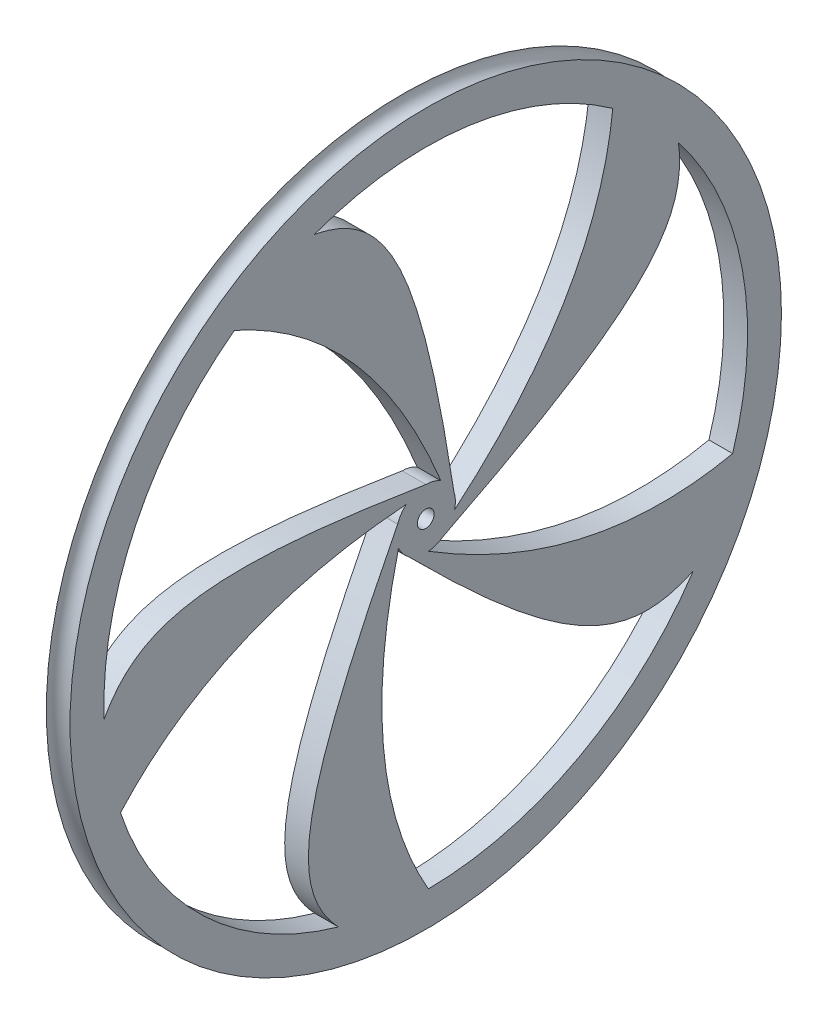
ISO-10303-21;
HEADER;
FILE_DESCRIPTION(('STEP AP214'),'2;1');
FILE_NAME('part.step','',(''),(''),'','','');
FILE_SCHEMA(('AUTOMOTIVE_DESIGN { 1 0 10303 214 1 1 1 1 }'));
ENDSEC;
DATA;
#1=APPLICATION_CONTEXT('core data for automotive mechanical design processes');
#2=APPLICATION_PROTOCOL_DEFINITION('international standard','automotive_design',2000,#1);
#3=PRODUCT_CONTEXT('',#1,'mechanical');
#4=PRODUCT('Part','Part','',(#3));
#5=PRODUCT_RELATED_PRODUCT_CATEGORY('part','',(#4));
#6=PRODUCT_DEFINITION_FORMATION('','',#4);
#7=PRODUCT_DEFINITION_CONTEXT('part definition',#1,'design');
#8=PRODUCT_DEFINITION('design','',#6,#7);
#9=PRODUCT_DEFINITION_SHAPE('','',#8);
#10=(LENGTH_UNIT() NAMED_UNIT(*) SI_UNIT(.MILLI.,.METRE.));
#11=(NAMED_UNIT(*) PLANE_ANGLE_UNIT() SI_UNIT($,.RADIAN.));
#12=(NAMED_UNIT(*) SI_UNIT($,.STERADIAN.) SOLID_ANGLE_UNIT());
#13=UNCERTAINTY_MEASURE_WITH_UNIT(LENGTH_MEASURE(1.E-05),#10,'distance_accuracy_value','');
#14=(GEOMETRIC_REPRESENTATION_CONTEXT(3) GLOBAL_UNCERTAINTY_ASSIGNED_CONTEXT((#13)) GLOBAL_UNIT_ASSIGNED_CONTEXT((#10,
#11,#12)) REPRESENTATION_CONTEXT('',''));
#15=CARTESIAN_POINT('',(0.,0.,0.));
#16=DIRECTION('',(0.,0.,1.));
#17=DIRECTION('',(1.,0.,0.));
#18=AXIS2_PLACEMENT_3D('',#15,#16,#17);
#19=CARTESIAN_POINT('',(0.,0.,0.));
#20=DIRECTION('',(1.,0.,0.));
#21=DIRECTION('',(0.,0.,-1.));
#22=AXIS2_PLACEMENT_3D('',#19,#20,#21);
#23=CYLINDRICAL_SURFACE('',#22,48.26);
#24=CARTESIAN_POINT('',(1.778,0.,0.));
#25=DIRECTION('',(1.,0.,0.));
#26=DIRECTION('',(0.,0.,-1.));
#27=AXIS2_PLACEMENT_3D('',#24,#25,#26);
#28=CIRCLE('',#27,48.26);
#29=CARTESIAN_POINT('',(1.778,-14.5390494606344,-46.0178621926446));
#30=VERTEX_POINT('',#29);
#31=CARTESIAN_POINT('',(1.778,29.8842796984911,-37.8940289082904));
#32=VERTEX_POINT('',#31);
#33=EDGE_CURVE('E189',#30,#32,#28,.T.);
#34=ORIENTED_EDGE('',*,*,#33,.T.);
#35=DIRECTION('',(-1.,0.,0.));
#36=VECTOR('',#35,1.);
#37=CARTESIAN_POINT('',(1.778,29.8842796984911,-37.8940289082904));
#38=LINE('',#37,#36);
#39=CARTESIAN_POINT('',(-1.778,29.8842796984911,-37.8940289082904));
#40=VERTEX_POINT('',#39);
#41=EDGE_CURVE('E65',#32,#40,#38,.T.);
#42=ORIENTED_EDGE('',*,*,#41,.T.);
#43=CARTESIAN_POINT('',(-1.778,0.,0.));
#44=DIRECTION('',(1.,0.,0.));
#45=DIRECTION('',(0.,0.,-1.));
#46=AXIS2_PLACEMENT_3D('',#43,#44,#45);
#47=CIRCLE('',#46,48.26);
#48=CARTESIAN_POINT('',(-1.778,-14.5390494606344,-46.0178621926446));
#49=VERTEX_POINT('',#48);
#50=EDGE_CURVE('E470',#49,#40,#47,.T.);
#51=ORIENTED_EDGE('',*,*,#50,.F.);
#52=DIRECTION('',(-1.,0.,0.));
#53=VECTOR('',#52,1.);
#54=CARTESIAN_POINT('',(1.778,-14.5390494606344,-46.0178621926446));
#55=LINE('',#54,#53);
#56=EDGE_CURVE('E244',#30,#49,#55,.T.);
#57=ORIENTED_EDGE('',*,*,#56,.F.);
#58=EDGE_LOOP('',(#34,#42,#51,#57));
#59=FACE_BOUND('',#58,.T.);
#60=ADVANCED_FACE('F41',(#59),#23,.F.);
#61=CARTESIAN_POINT('',(1.778,0.,0.));
#62=DIRECTION('',(-1.,0.,0.));
#63=DIRECTION('',(0.,0.,1.));
#64=AXIS2_PLACEMENT_3D('',#61,#62,#63);
#65=CYLINDRICAL_SURFACE('',#64,4.445);
#66=DIRECTION('',(-1.,0.,0.));
#67=VECTOR('',#66,1.);
#68=CARTESIAN_POINT('',(1.778,-3.61700582745716,-2.58365900306928));
#69=LINE('',#68,#67);
#70=CARTESIAN_POINT('',(1.778,-3.61700582745716,-2.58365900306928));
#71=VERTEX_POINT('',#70);
#72=CARTESIAN_POINT('',(-1.778,-3.61700582745716,-2.58365900306928));
#73=VERTEX_POINT('',#72);
#74=EDGE_CURVE('E547',#71,#73,#69,.T.);
#75=ORIENTED_EDGE('',*,*,#74,.F.);
#76=CARTESIAN_POINT('',(1.778,0.,0.));
#77=DIRECTION('',(1.,0.,0.));
#78=DIRECTION('',(0.,0.,-1.));
#79=AXIS2_PLACEMENT_3D('',#76,#77,#78);
#80=CIRCLE('',#79,4.445);
#81=CARTESIAN_POINT('',(1.778,-4.42596173429695,-0.410959519343638));
#82=VERTEX_POINT('',#81);
#83=EDGE_CURVE('E570',#82,#71,#80,.T.);
#84=ORIENTED_EDGE('',*,*,#83,.F.);
#85=DIRECTION('',(-1.,0.,0.));
#86=VECTOR('',#85,1.);
#87=CARTESIAN_POINT('',(1.778,-4.42596173429695,-0.410959519343638));
#88=LINE('',#87,#86);
#89=CARTESIAN_POINT('',(-1.778,-4.42596173429695,-0.410959519343638));
#90=VERTEX_POINT('',#89);
#91=EDGE_CURVE('E281',#82,#90,#88,.T.);
#92=ORIENTED_EDGE('',*,*,#91,.T.);
#93=CARTESIAN_POINT('',(-1.778,0.,0.));
#94=DIRECTION('',(1.,0.,0.));
#95=DIRECTION('',(0.,0.,-1.));
#96=AXIS2_PLACEMENT_3D('',#93,#94,#95);
#97=CIRCLE('',#96,4.445);
#98=EDGE_CURVE('E545',#90,#73,#97,.T.);
#99=ORIENTED_EDGE('',*,*,#98,.T.);
#100=EDGE_LOOP('',(#75,#84,#92,#99));
#101=FACE_BOUND('',#100,.T.);
#102=ADVANCED_FACE('F421',(#101),#65,.T.);
#103=CARTESIAN_POINT('',(1.778,-48.258401069681,-0.39284373205755));
#104=VERTEX_POINT('',#103);
#105=CARTESIAN_POINT('',(1.778,-26.8046128304187,-40.1315378600342));
#106=VERTEX_POINT('',#105);
#107=EDGE_CURVE('E448',#104,#106,#28,.T.);
#108=ORIENTED_EDGE('',*,*,#107,.T.);
#109=DIRECTION('',(-1.,0.,0.));
#110=VECTOR('',#109,1.);
#111=CARTESIAN_POINT('',(1.778,-26.8046128304187,-40.1315378600342));
#112=LINE('',#111,#110);
#113=CARTESIAN_POINT('',(-1.778,-26.8046128304187,-40.1315378600342));
#114=VERTEX_POINT('',#113);
#115=EDGE_CURVE('E274',#106,#114,#112,.T.);
#116=ORIENTED_EDGE('',*,*,#115,.T.);
#117=CARTESIAN_POINT('',(-1.778,-48.2584010696809,-0.39284373205756));
#118=VERTEX_POINT('',#117);
#119=EDGE_CURVE('E467',#118,#114,#47,.T.);
#120=ORIENTED_EDGE('',*,*,#119,.F.);
#121=DIRECTION('',(-1.,0.,0.));
#122=VECTOR('',#121,1.);
#123=CARTESIAN_POINT('',(1.778,-48.258401069681,-0.39284373205755));
#124=LINE('',#123,#122);
#125=EDGE_CURVE('E452',#104,#118,#124,.T.);
#126=ORIENTED_EDGE('',*,*,#125,.F.);
#127=EDGE_LOOP('',(#108,#116,#120,#126));
#128=FACE_BOUND('',#127,.T.);
#129=ADVANCED_FACE('F422',(#128),#23,.F.);
#130=DIRECTION('',(-1.,0.,0.));
#131=VECTOR('',#130,1.);
#132=CARTESIAN_POINT('',(1.778,-3.57492200019116,2.64158242206244));
#133=LINE('',#132,#131);
#134=CARTESIAN_POINT('',(1.778,-3.57492200019116,2.64158242206244));
#135=VERTEX_POINT('',#134);
#136=CARTESIAN_POINT('',(-1.778,-3.57492200019115,2.64158242206244));
#137=VERTEX_POINT('',#136);
#138=EDGE_CURVE('E277',#135,#137,#133,.T.);
#139=ORIENTED_EDGE('',*,*,#138,.F.);
#140=CARTESIAN_POINT('',(1.778,-1.75854312115625,4.08234627279877));
#141=VERTEX_POINT('',#140);
#142=EDGE_CURVE('E460',#141,#135,#80,.T.);
#143=ORIENTED_EDGE('',*,*,#142,.F.);
#144=DIRECTION('',(-1.,0.,0.));
#145=VECTOR('',#144,1.);
#146=CARTESIAN_POINT('',(1.778,-1.75854312115625,4.08234627279877));
#147=LINE('',#146,#145);
#148=CARTESIAN_POINT('',(-1.778,-1.75854312115625,4.08234627279877));
#149=VERTEX_POINT('',#148);
#150=EDGE_CURVE('E339',#141,#149,#147,.T.);
#151=ORIENTED_EDGE('',*,*,#150,.T.);
#152=EDGE_CURVE('E465',#149,#137,#97,.T.);
#153=ORIENTED_EDGE('',*,*,#152,.T.);
#154=EDGE_LOOP('',(#139,#143,#151,#153));
#155=FACE_BOUND('',#154,.T.);
#156=ADVANCED_FACE('F434',(#155),#65,.T.);
#157=CARTESIAN_POINT('',(1.778,-15.2862826431525,45.7750714139657));
#158=VERTEX_POINT('',#157);
#159=CARTESIAN_POINT('',(1.778,-46.4504414829712,13.0913744899863));
#160=VERTEX_POINT('',#159);
#161=EDGE_CURVE('E456',#158,#160,#28,.T.);
#162=ORIENTED_EDGE('',*,*,#161,.T.);
#163=DIRECTION('',(-1.,0.,0.));
#164=VECTOR('',#163,1.);
#165=CARTESIAN_POINT('',(1.778,-46.4504414829712,13.0913744899863));
#166=LINE('',#165,#164);
#167=CARTESIAN_POINT('',(-1.778,-46.4504414829712,13.0913744899863));
#168=VERTEX_POINT('',#167);
#169=EDGE_CURVE('E589',#160,#168,#166,.T.);
#170=ORIENTED_EDGE('',*,*,#169,.T.);
#171=CARTESIAN_POINT('',(-1.778,-15.2862826431525,45.7750714139656));
#172=VERTEX_POINT('',#171);
#173=EDGE_CURVE('E50',#172,#168,#47,.T.);
#174=ORIENTED_EDGE('',*,*,#173,.F.);
#175=DIRECTION('',(-1.,0.,0.));
#176=VECTOR('',#175,1.);
#177=CARTESIAN_POINT('',(1.778,-15.2862826431525,45.7750714139657));
#178=LINE('',#177,#176);
#179=EDGE_CURVE('E323',#158,#172,#178,.T.);
#180=ORIENTED_EDGE('',*,*,#179,.F.);
#181=EDGE_LOOP('',(#162,#170,#174,#180));
#182=FACE_BOUND('',#181,.T.);
#183=ADVANCED_FACE('F426',(#182),#23,.F.);
#184=DIRECTION('',(-1.,0.,0.));
#185=VECTOR('',#184,1.);
#186=CARTESIAN_POINT('',(1.778,1.40758252420929,4.21624672398813));
#187=LINE('',#186,#185);
#188=CARTESIAN_POINT('',(1.778,1.40758252420929,4.21624672398813));
#189=VERTEX_POINT('',#188);
#190=CARTESIAN_POINT('',(-1.778,1.40758252420929,4.21624672398813));
#191=VERTEX_POINT('',#190);
#192=EDGE_CURVE('E586',#189,#191,#187,.T.);
#193=ORIENTED_EDGE('',*,*,#192,.F.);
#194=CARTESIAN_POINT('',(1.778,3.33912231474007,2.93398826977971));
#195=VERTEX_POINT('',#194);
#196=EDGE_CURVE('E377',#195,#189,#80,.T.);
#197=ORIENTED_EDGE('',*,*,#196,.F.);
#198=DIRECTION('',(-1.,0.,0.));
#199=VECTOR('',#198,1.);
#200=CARTESIAN_POINT('',(1.778,3.33912231474007,2.93398826977971));
#201=LINE('',#200,#199);
#202=CARTESIAN_POINT('',(-1.778,3.33912231474007,2.93398826977971));
#203=VERTEX_POINT('',#202);
#204=EDGE_CURVE('E361',#195,#203,#201,.T.);
#205=ORIENTED_EDGE('',*,*,#204,.T.);
#206=EDGE_CURVE('E384',#203,#191,#97,.T.);
#207=ORIENTED_EDGE('',*,*,#206,.T.);
#208=EDGE_LOOP('',(#193,#197,#205,#207));
#209=FACE_BOUND('',#208,.T.);
#210=ADVANCED_FACE('F424',(#209),#65,.T.);
#211=CARTESIAN_POINT('',(1.778,38.8109588345752,28.6833937033418));
#212=VERTEX_POINT('',#211);
#213=CARTESIAN_POINT('',(1.778,-1.90333879849536,48.222452254299));
#214=VERTEX_POINT('',#213);
#215=EDGE_CURVE('E191',#212,#214,#28,.T.);
#216=ORIENTED_EDGE('',*,*,#215,.T.);
#217=DIRECTION('',(-1.,0.,0.));
#218=VECTOR('',#217,1.);
#219=CARTESIAN_POINT('',(1.778,-1.90333879849536,48.222452254299));
#220=LINE('',#219,#218);
#221=CARTESIAN_POINT('',(-1.778,-1.90333879849536,48.222452254299));
#222=VERTEX_POINT('',#221);
#223=EDGE_CURVE('E354',#214,#222,#220,.T.);
#224=ORIENTED_EDGE('',*,*,#223,.T.);
#225=CARTESIAN_POINT('',(-1.778,38.8109588345752,28.6833937033418));
#226=VERTEX_POINT('',#225);
#227=EDGE_CURVE('E11',#226,#222,#47,.T.);
#228=ORIENTED_EDGE('',*,*,#227,.F.);
#229=DIRECTION('',(-1.,0.,0.));
#230=VECTOR('',#229,1.);
#231=CARTESIAN_POINT('',(1.778,38.8109588345752,28.6833937033418));
#232=LINE('',#231,#230);
#233=EDGE_CURVE('E499',#212,#226,#232,.T.);
#234=ORIENTED_EDGE('',*,*,#233,.F.);
#235=EDGE_LOOP('',(#216,#224,#228,#234));
#236=FACE_BOUND('',#235,.T.);
#237=ADVANCED_FACE('F414',(#236),#23,.F.);
#238=DIRECTION('',(-1.,0.,0.));
#239=VECTOR('',#238,1.);
#240=CARTESIAN_POINT('',(1.778,4.44485584212286,-0.0357986416824048));
#241=LINE('',#240,#239);
#242=CARTESIAN_POINT('',(1.778,4.44485584212286,-0.0357986416824048));
#243=VERTEX_POINT('',#242);
#244=CARTESIAN_POINT('',(-1.778,4.44485584212286,-0.0357986416824042));
#245=VERTEX_POINT('',#244);
#246=EDGE_CURVE('E357',#243,#245,#241,.T.);
#247=ORIENTED_EDGE('',*,*,#246,.F.);
#248=CARTESIAN_POINT('',(1.778,3.82223420425882,-2.26904179948143));
#249=VERTEX_POINT('',#248);
#250=EDGE_CURVE('E372',#249,#243,#80,.T.);
#251=ORIENTED_EDGE('',*,*,#250,.F.);
#252=DIRECTION('',(-1.,0.,0.));
#253=VECTOR('',#252,1.);
#254=CARTESIAN_POINT('',(1.778,3.82223420425882,-2.26904179948143));
#255=LINE('',#254,#253);
#256=CARTESIAN_POINT('',(-1.778,3.82223420425882,-2.26904179948143));
#257=VERTEX_POINT('',#256);
#258=EDGE_CURVE('E489',#249,#257,#255,.T.);
#259=ORIENTED_EDGE('',*,*,#258,.T.);
#260=EDGE_CURVE('E371',#257,#245,#97,.T.);
#261=ORIENTED_EDGE('',*,*,#260,.T.);
#262=EDGE_LOOP('',(#247,#251,#259,#261));
#263=FACE_BOUND('',#262,.T.);
#264=ADVANCED_FACE('F418',(#263),#65,.T.);
#265=CARTESIAN_POINT('',(-1.778,48.26,0.));
#266=DIRECTION('',(-1.,0.,0.));
#267=DIRECTION('',(0.,0.,1.));
#268=AXIS2_PLACEMENT_3D('',#265,#266,#267);
#269=PLANE('',#268);
#270=CARTESIAN_POINT('',(-1.778,-0.97685166354567,-4.33633322375346));
#271=CARTESIAN_POINT('',(-1.778,26.5106468763643,-36.8169707499922));
#272=CARTESIAN_POINT('',(-1.778,63.374014977111,-25.3335626529753));
#273=B_SPLINE_CURVE_WITH_KNOTS('',2,(#270,#271,#272),.UNSPECIFIED.,.F.,.F.,(3,3),(0.,1.),.UNSPECIFIED.);
#274=CARTESIAN_POINT('',(-1.778,-0.97685166354567,-4.33633322375346));
#275=VERTEX_POINT('',#274);
#276=CARTESIAN_POINT('',(-1.778,39.2727743388932,-28.0477591926053));
#277=VERTEX_POINT('',#276);
#278=EDGE_CURVE('E212',#275,#277,#273,.T.);
#279=ORIENTED_EDGE('',*,*,#278,.T.);
#280=CARTESIAN_POINT('',(-1.778,45.2741134133947,16.7117400240391));
#281=VERTEX_POINT('',#280);
#282=EDGE_CURVE('E51',#277,#281,#47,.T.);
#283=ORIENTED_EDGE('',*,*,#282,.T.);
#284=CARTESIAN_POINT('',(-1.778,0.,-4.445));
#285=CARTESIAN_POINT('',(-1.778,33.4176853978856,0.66300653128449));
#286=CARTESIAN_POINT('',(-1.778,50.2134508342104,9.11815874466706));
#287=CARTESIAN_POINT('',(-1.778,44.2773548932721,35.8030298366815));
#288=CARTESIAN_POINT('',(-1.778,43.6772974717841,52.4437685199361));
#289=B_SPLINE_CURVE_WITH_KNOTS('',3,(#284,#285,#286,#287,#288),.UNSPECIFIED.,.F.,.F.,(4,1,4),
(0.,0.5828413419792,1.),.UNSPECIFIED.);
#290=CARTESIAN_POINT('',(-1.778,1.33948946131615,-4.23837150129893));
#291=VERTEX_POINT('',#290);
#292=EDGE_CURVE('E392',#291,#281,#289,.T.);
#293=ORIENTED_EDGE('',*,*,#292,.F.);
#294=EDGE_CURVE('E381',#275,#291,#97,.T.);
#295=ORIENTED_EDGE('',*,*,#294,.F.);
#296=EDGE_LOOP('',(#279,#283,#293,#295));
#297=FACE_BOUND('',#296,.T.);
#298=CARTESIAN_POINT('',(-1.778,-4.42596173429695,-0.410959519343638));
#299=CARTESIAN_POINT('',(-1.778,-26.8227795253586,-36.5901931061189));
#300=CARTESIAN_POINT('',(-1.778,-4.51000221238416,-68.1007712955999));
#301=B_SPLINE_CURVE_WITH_KNOTS('',2,(#298,#299,#300),.UNSPECIFIED.,.F.,.F.,(3,3),(0.,1.),.UNSPECIFIED.);
#302=EDGE_CURVE('E250',#90,#49,#301,.T.);
#303=ORIENTED_EDGE('',*,*,#302,.T.);
#304=ORIENTED_EDGE('',*,*,#50,.T.);
#305=CARTESIAN_POINT('',(-1.778,-4.22744621493194,-1.37358053999669));
#306=CARTESIAN_POINT('',(-1.778,10.9571893825469,-31.5772271716119));
#307=CARTESIAN_POINT('',(-1.778,24.1886939447116,-44.9381636120311));
#308=CARTESIAN_POINT('',(-1.778,47.7331599572779,-31.0465222259111));
#309=CARTESIAN_POINT('',(-1.778,63.3740149771114,-25.3335626529752));
#310=B_SPLINE_CURVE_WITH_KNOTS('',3,(#305,#306,#307,#308,#309),.UNSPECIFIED.,.F.,.F.,(4,1,4),
(0.,0.5828413419792,1.),.UNSPECIFIED.);
#311=EDGE_CURVE('E205',#73,#40,#310,.T.);
#312=ORIENTED_EDGE('',*,*,#311,.F.);
#313=ORIENTED_EDGE('',*,*,#98,.F.);
#314=EDGE_LOOP('',(#303,#304,#312,#313));
#315=FACE_BOUND('',#314,.T.);
#316=CARTESIAN_POINT('',(-1.778,-1.75854312115625,4.08234627279877));
#317=CARTESIAN_POINT('',(-1.778,-43.0880362957805,14.2029877554888));
#318=CARTESIAN_POINT('',(-1.778,-66.1613496337016,-16.7550286677883));
#319=B_SPLINE_CURVE_WITH_KNOTS('',2,(#316,#317,#318),.UNSPECIFIED.,.F.,.F.,(3,3),(0.,1.),.UNSPECIFIED.);
#320=EDGE_CURVE('E285',#149,#118,#319,.T.);
#321=ORIENTED_EDGE('',*,*,#320,.T.);
#322=ORIENTED_EDGE('',*,*,#119,.T.);
#323=CARTESIAN_POINT('',(-1.778,-2.61270544644007,3.59608053999662));
#324=CARTESIAN_POINT('',(-1.778,-26.6457699383022,-20.1788061938176));
#325=CARTESIAN_POINT('',(-1.778,-35.2640158329098,-36.8914712489065));
#326=CARTESIAN_POINT('',(-1.778,-14.7766396492386,-54.9908358047741));
#327=CARTESIAN_POINT('',(-1.778,-4.51000221238391,-68.1007712956002));
#328=B_SPLINE_CURVE_WITH_KNOTS('',3,(#323,#324,#325,#326,#327),.UNSPECIFIED.,.F.,.F.,(4,1,4),
(0.,0.5828413419792,1.),.UNSPECIFIED.);
#329=EDGE_CURVE('E259',#137,#114,#328,.T.);
#330=ORIENTED_EDGE('',*,*,#329,.F.);
#331=ORIENTED_EDGE('',*,*,#152,.F.);
#332=EDGE_LOOP('',(#321,#322,#330,#331));
#333=FACE_BOUND('',#332,.T.);
#334=CARTESIAN_POINT('',(-1.778,3.33912231474007,2.93398826977971));
#335=CARTESIAN_POINT('',(-1.778,0.19290858607734,45.3681222808095));
#336=CARTESIAN_POINT('',(-1.778,-36.3799606028085,57.745594096428));
#337=B_SPLINE_CURVE_WITH_KNOTS('',2,(#334,#335,#336),.UNSPECIFIED.,.F.,.F.,(3,3),(0.,1.),.UNSPECIFIED.);
#338=EDGE_CURVE('E329',#203,#172,#337,.T.);
#339=ORIENTED_EDGE('',*,*,#338,.T.);
#340=ORIENTED_EDGE('',*,*,#173,.T.);
#341=CARTESIAN_POINT('',(-1.778,2.61270544644003,3.59608053999665));
#342=CARTESIAN_POINT('',(-1.778,-27.4251808608277,19.1060390914358));
#343=CARTESIAN_POINT('',(-1.778,-45.9830543092641,22.1379804852176));
#344=CARTESIAN_POINT('',(-1.778,-56.8656255000166,-2.93968337120366));
#345=CARTESIAN_POINT('',(-1.778,-66.1613496337018,-16.7550286677886));
#346=B_SPLINE_CURVE_WITH_KNOTS('',3,(#341,#342,#343,#344,#345),.UNSPECIFIED.,.F.,.F.,(4,1,4),
(0.,0.5828413419792,1.),.UNSPECIFIED.);
#347=EDGE_CURVE('E294',#191,#168,#346,.T.);
#348=ORIENTED_EDGE('',*,*,#347,.F.);
#349=ORIENTED_EDGE('',*,*,#206,.F.);
#350=EDGE_LOOP('',(#339,#340,#348,#349));
#351=FACE_BOUND('',#350,.T.);
#352=ORIENTED_EDGE('',*,*,#227,.T.);
#353=CARTESIAN_POINT('',(-1.778,4.22744621493196,-1.37358053999663));
#354=CARTESIAN_POINT('',(-1.778,9.69607601869772,31.986987742709));
#355=CARTESIAN_POINT('',(-1.778,6.8449253632525,50.5734956310528));
#356=CARTESIAN_POINT('',(-1.778,-20.3682497012941,53.1740115652074));
#357=CARTESIAN_POINT('',(-1.778,-36.3799606028089,57.7455940964281));
#358=B_SPLINE_CURVE_WITH_KNOTS('',3,(#353,#354,#355,#356,#357),.UNSPECIFIED.,.F.,.F.,(4,1,4),
(0.,0.5828413419792,1.),.UNSPECIFIED.);
#359=EDGE_CURVE('E338',#245,#222,#358,.T.);
#360=ORIENTED_EDGE('',*,*,#359,.F.);
#361=ORIENTED_EDGE('',*,*,#260,.F.);
#362=CARTESIAN_POINT('',(-1.778,3.82223420425882,-2.26904179948143));
#363=CARTESIAN_POINT('',(-1.778,43.207260358698,13.8360538198126));
#364=CARTESIAN_POINT('',(-1.778,43.6772974717841,52.4437685199357));
#365=B_SPLINE_CURVE_WITH_KNOTS('',2,(#362,#363,#364),.UNSPECIFIED.,.F.,.F.,(3,3),(0.,1.),.UNSPECIFIED.);
#366=EDGE_CURVE('E376',#257,#226,#365,.T.);
#367=ORIENTED_EDGE('',*,*,#366,.T.);
#368=EDGE_LOOP('',(#352,#360,#361,#367));
#369=FACE_BOUND('',#368,.T.);
#370=CARTESIAN_POINT('',(-1.778,0.,0.));
#371=DIRECTION('',(1.,0.,0.));
#372=DIRECTION('',(0.,0.,-1.));
#373=AXIS2_PLACEMENT_3D('',#370,#371,#372);
#374=CIRCLE('',#373,53.34);
#375=CARTESIAN_POINT('',(-1.778,0.,-53.34));
#376=VERTEX_POINT('',#375);
#377=EDGE_CURVE('E485',#376,#376,#374,.T.);
#378=ORIENTED_EDGE('',*,*,#377,.F.);
#379=EDGE_LOOP('',(#378));
#380=FACE_BOUND('',#379,.T.);
#381=CARTESIAN_POINT('',(-1.778,0.,0.));
#382=DIRECTION('',(1.,0.,0.));
#383=DIRECTION('',(0.,0.,-1.));
#384=AXIS2_PLACEMENT_3D('',#381,#382,#383);
#385=CIRCLE('',#384,1.2573);
#386=CARTESIAN_POINT('',(-1.778,0.,-1.2573));
#387=VERTEX_POINT('',#386);
#388=EDGE_CURVE('E365',#387,#387,#385,.T.);
#389=ORIENTED_EDGE('',*,*,#388,.T.);
#390=EDGE_LOOP('',(#389));
#391=FACE_BOUND('',#390,.T.);
#392=ADVANCED_FACE('F43',(#297,#315,#333,#351,#369,#380,#391),#269,.T.);
#393=DIRECTION('',(-1.,0.,0.));
#394=VECTOR('',#393,1.);
#395=CARTESIAN_POINT('',(1.778,39.2727743388932,-28.0477591926053));
#396=LINE('',#395,#394);
#397=CARTESIAN_POINT('',(1.778,39.2727743388932,-28.0477591926053));
#398=VERTEX_POINT('',#397);
#399=EDGE_CURVE('E192',#398,#277,#396,.T.);
#400=ORIENTED_EDGE('',*,*,#399,.F.);
#401=CARTESIAN_POINT('',(1.778,45.2741134133947,16.7117400240391));
#402=VERTEX_POINT('',#401);
#403=EDGE_CURVE('E180',#398,#402,#28,.T.);
#404=ORIENTED_EDGE('',*,*,#403,.T.);
#405=DIRECTION('',(-1.,0.,0.));
#406=VECTOR('',#405,1.);
#407=CARTESIAN_POINT('',(1.778,45.2741134133947,16.7117400240391));
#408=LINE('',#407,#406);
#409=EDGE_CURVE('E496',#402,#281,#408,.T.);
#410=ORIENTED_EDGE('',*,*,#409,.T.);
#411=ORIENTED_EDGE('',*,*,#282,.F.);
#412=EDGE_LOOP('',(#400,#404,#410,#411));
#413=FACE_BOUND('',#412,.T.);
#414=ADVANCED_FACE('F193',(#413),#23,.F.);
#415=CARTESIAN_POINT('',(1.778,48.26,0.));
#416=DIRECTION('',(1.,0.,0.));
#417=DIRECTION('',(0.,0.,-1.));
#418=AXIS2_PLACEMENT_3D('',#415,#416,#417);
#419=PLANE('',#418);
#420=ORIENTED_EDGE('',*,*,#403,.F.);
#421=CARTESIAN_POINT('',(1.778,-0.97685166354567,-4.33633322375346));
#422=CARTESIAN_POINT('',(1.778,26.5106468763643,-36.8169707499922));
#423=CARTESIAN_POINT('',(1.778,63.374014977111,-25.3335626529753));
#424=B_SPLINE_CURVE_WITH_KNOTS('',2,(#421,#422,#423),.UNSPECIFIED.,.F.,.F.,(3,3),(0.,1.),.UNSPECIFIED.);
#425=CARTESIAN_POINT('',(1.778,-0.97685166354567,-4.33633322375346));
#426=VERTEX_POINT('',#425);
#427=EDGE_CURVE('E184',#426,#398,#424,.T.);
#428=ORIENTED_EDGE('',*,*,#427,.F.);
#429=CARTESIAN_POINT('',(1.778,1.33948946131615,-4.23837150129893));
#430=VERTEX_POINT('',#429);
#431=EDGE_CURVE('E370',#426,#430,#80,.T.);
#432=ORIENTED_EDGE('',*,*,#431,.T.);
#433=CARTESIAN_POINT('',(1.778,0.,-4.445));
#434=CARTESIAN_POINT('',(1.778,33.4176853978856,0.66300653128449));
#435=CARTESIAN_POINT('',(1.778,50.2134508342104,9.11815874466706));
#436=CARTESIAN_POINT('',(1.778,44.2773548932721,35.8030298366815));
#437=CARTESIAN_POINT('',(1.778,43.6772974717841,52.4437685199361));
#438=B_SPLINE_CURVE_WITH_KNOTS('',3,(#433,#434,#435,#436,#437),.UNSPECIFIED.,.F.,.F.,(4,1,4),
(0.,0.5828413419792,1.),.UNSPECIFIED.);
#439=EDGE_CURVE('E186',#430,#402,#438,.T.);
#440=ORIENTED_EDGE('',*,*,#439,.T.);
#441=EDGE_LOOP('',(#420,#428,#432,#440));
#442=FACE_BOUND('',#441,.T.);
#443=ORIENTED_EDGE('',*,*,#33,.F.);
#444=CARTESIAN_POINT('',(1.778,-4.42596173429695,-0.410959519343638));
#445=CARTESIAN_POINT('',(1.778,-26.8227795253586,-36.5901931061189));
#446=CARTESIAN_POINT('',(1.778,-4.51000221238416,-68.1007712955999));
#447=B_SPLINE_CURVE_WITH_KNOTS('',2,(#444,#445,#446),.UNSPECIFIED.,.F.,.F.,(3,3),(0.,1.),.UNSPECIFIED.);
#448=EDGE_CURVE('E245',#82,#30,#447,.T.);
#449=ORIENTED_EDGE('',*,*,#448,.F.);
#450=ORIENTED_EDGE('',*,*,#83,.T.);
#451=CARTESIAN_POINT('',(1.778,-4.22744621493194,-1.37358053999669));
#452=CARTESIAN_POINT('',(1.778,10.9571893825469,-31.5772271716119));
#453=CARTESIAN_POINT('',(1.778,24.1886939447116,-44.9381636120311));
#454=CARTESIAN_POINT('',(1.778,47.7331599572779,-31.0465222259111));
#455=CARTESIAN_POINT('',(1.778,63.3740149771114,-25.3335626529752));
#456=B_SPLINE_CURVE_WITH_KNOTS('',3,(#451,#452,#453,#454,#455),.UNSPECIFIED.,.F.,.F.,(4,1,4),
(0.,0.5828413419792,1.),.UNSPECIFIED.);
#457=EDGE_CURVE('E198',#71,#32,#456,.T.);
#458=ORIENTED_EDGE('',*,*,#457,.T.);
#459=EDGE_LOOP('',(#443,#449,#450,#458));
#460=FACE_BOUND('',#459,.T.);
#461=ORIENTED_EDGE('',*,*,#107,.F.);
#462=CARTESIAN_POINT('',(1.778,-1.75854312115625,4.08234627279877));
#463=CARTESIAN_POINT('',(1.778,-43.0880362957805,14.2029877554888));
#464=CARTESIAN_POINT('',(1.778,-66.1613496337016,-16.7550286677883));
#465=B_SPLINE_CURVE_WITH_KNOTS('',2,(#462,#463,#464),.UNSPECIFIED.,.F.,.F.,(3,3),(0.,1.),.UNSPECIFIED.);
#466=EDGE_CURVE('E286',#141,#104,#465,.T.);
#467=ORIENTED_EDGE('',*,*,#466,.F.);
#468=ORIENTED_EDGE('',*,*,#142,.T.);
#469=CARTESIAN_POINT('',(1.778,-2.61270544644007,3.59608053999662));
#470=CARTESIAN_POINT('',(1.778,-26.6457699383022,-20.1788061938176));
#471=CARTESIAN_POINT('',(1.778,-35.2640158329098,-36.8914712489065));
#472=CARTESIAN_POINT('',(1.778,-14.7766396492386,-54.9908358047741));
#473=CARTESIAN_POINT('',(1.778,-4.51000221238391,-68.1007712956002));
#474=B_SPLINE_CURVE_WITH_KNOTS('',3,(#469,#470,#471,#472,#473),.UNSPECIFIED.,.F.,.F.,(4,1,4),
(0.,0.5828413419792,1.),.UNSPECIFIED.);
#475=EDGE_CURVE('E237',#135,#106,#474,.T.);
#476=ORIENTED_EDGE('',*,*,#475,.T.);
#477=EDGE_LOOP('',(#461,#467,#468,#476));
#478=FACE_BOUND('',#477,.T.);
#479=ORIENTED_EDGE('',*,*,#161,.F.);
#480=CARTESIAN_POINT('',(1.778,3.33912231474007,2.93398826977971));
#481=CARTESIAN_POINT('',(1.778,0.19290858607734,45.3681222808095));
#482=CARTESIAN_POINT('',(1.778,-36.3799606028085,57.745594096428));
#483=B_SPLINE_CURVE_WITH_KNOTS('',2,(#480,#481,#482),.UNSPECIFIED.,.F.,.F.,(3,3),(0.,1.),.UNSPECIFIED.);
#484=EDGE_CURVE('E324',#195,#158,#483,.T.);
#485=ORIENTED_EDGE('',*,*,#484,.F.);
#486=ORIENTED_EDGE('',*,*,#196,.T.);
#487=CARTESIAN_POINT('',(1.778,2.61270544644003,3.59608053999665));
#488=CARTESIAN_POINT('',(1.778,-27.4251808608277,19.1060390914358));
#489=CARTESIAN_POINT('',(1.778,-45.9830543092641,22.1379804852176));
#490=CARTESIAN_POINT('',(1.778,-56.8656255000166,-2.93968337120366));
#491=CARTESIAN_POINT('',(1.778,-66.1613496337018,-16.7550286677886));
#492=B_SPLINE_CURVE_WITH_KNOTS('',3,(#487,#488,#489,#490,#491),.UNSPECIFIED.,.F.,.F.,(4,1,4),
(0.,0.5828413419792,1.),.UNSPECIFIED.);
#493=EDGE_CURVE('E293',#189,#160,#492,.T.);
#494=ORIENTED_EDGE('',*,*,#493,.T.);
#495=EDGE_LOOP('',(#479,#485,#486,#494));
#496=FACE_BOUND('',#495,.T.);
#497=CARTESIAN_POINT('',(1.778,0.,0.));
#498=DIRECTION('',(1.,0.,0.));
#499=DIRECTION('',(0.,0.,-1.));
#500=AXIS2_PLACEMENT_3D('',#497,#498,#499);
#501=CIRCLE('',#500,53.34);
#502=CARTESIAN_POINT('',(1.778,0.,-53.34));
#503=VERTEX_POINT('',#502);
#504=EDGE_CURVE('E190',#503,#503,#501,.T.);
#505=ORIENTED_EDGE('',*,*,#504,.T.);
#506=EDGE_LOOP('',(#505));
#507=FACE_BOUND('',#506,.T.);
#508=ORIENTED_EDGE('',*,*,#215,.F.);
#509=CARTESIAN_POINT('',(1.778,3.82223420425882,-2.26904179948143));
#510=CARTESIAN_POINT('',(1.778,43.207260358698,13.8360538198126));
#511=CARTESIAN_POINT('',(1.778,43.6772974717841,52.4437685199357));
#512=B_SPLINE_CURVE_WITH_KNOTS('',2,(#509,#510,#511),.UNSPECIFIED.,.F.,.F.,(3,3),(0.,1.),.UNSPECIFIED.);
#513=EDGE_CURVE('E385',#249,#212,#512,.T.);
#514=ORIENTED_EDGE('',*,*,#513,.F.);
#515=ORIENTED_EDGE('',*,*,#250,.T.);
#516=CARTESIAN_POINT('',(1.778,4.22744621493196,-1.37358053999663));
#517=CARTESIAN_POINT('',(1.778,9.69607601869772,31.986987742709));
#518=CARTESIAN_POINT('',(1.778,6.8449253632525,50.5734956310528));
#519=CARTESIAN_POINT('',(1.778,-20.3682497012941,53.1740115652074));
#520=CARTESIAN_POINT('',(1.778,-36.3799606028089,57.7455940964281));
#521=B_SPLINE_CURVE_WITH_KNOTS('',3,(#516,#517,#518,#519,#520),.UNSPECIFIED.,.F.,.F.,(4,1,4),
(0.,0.5828413419792,1.),.UNSPECIFIED.);
#522=EDGE_CURVE('E316',#243,#214,#521,.T.);
#523=ORIENTED_EDGE('',*,*,#522,.T.);
#524=EDGE_LOOP('',(#508,#514,#515,#523));
#525=FACE_BOUND('',#524,.T.);
#526=CARTESIAN_POINT('',(1.778,0.,0.));
#527=DIRECTION('',(1.,0.,0.));
#528=DIRECTION('',(0.,0.,-1.));
#529=AXIS2_PLACEMENT_3D('',#526,#527,#528);
#530=CIRCLE('',#529,1.2573);
#531=CARTESIAN_POINT('',(1.778,0.,-1.2573));
#532=VERTEX_POINT('',#531);
#533=EDGE_CURVE('E366',#532,#532,#530,.T.);
#534=ORIENTED_EDGE('',*,*,#533,.F.);
#535=EDGE_LOOP('',(#534));
#536=FACE_BOUND('',#535,.T.);
#537=ADVANCED_FACE('F181',(#442,#460,#478,#496,#507,#525,#536),#419,.T.);
#538=CARTESIAN_POINT('',(0.,0.,0.));
#539=DIRECTION('',(1.,0.,0.));
#540=DIRECTION('',(0.,0.,-1.));
#541=AXIS2_PLACEMENT_3D('',#538,#539,#540);
#542=TOROIDAL_SURFACE('',#541,53.34,1.778);
#543=ORIENTED_EDGE('',*,*,#377,.T.);
#544=EDGE_LOOP('',(#543));
#545=FACE_BOUND('',#544,.T.);
#546=ORIENTED_EDGE('',*,*,#504,.F.);
#547=EDGE_LOOP('',(#546));
#548=FACE_BOUND('',#547,.T.);
#549=ADVANCED_FACE('F406',(#545,#548),#542,.F.);
#550=DIRECTION('',(-1.,0.,0.));
#551=VECTOR('',#550,1.);
#552=SURFACE_OF_LINEAR_EXTRUSION('',#512,#551);
#553=ORIENTED_EDGE('',*,*,#366,.F.);
#554=ORIENTED_EDGE('',*,*,#258,.F.);
#555=ORIENTED_EDGE('',*,*,#513,.T.);
#556=ORIENTED_EDGE('',*,*,#233,.T.);
#557=EDGE_LOOP('',(#553,#554,#555,#556));
#558=FACE_BOUND('',#557,.T.);
#559=ADVANCED_FACE('F401',(#558),#552,.T.);
#560=DIRECTION('',(-1.,0.,0.));
#561=VECTOR('',#560,1.);
#562=SURFACE_OF_LINEAR_EXTRUSION('',#438,#561);
#563=ORIENTED_EDGE('',*,*,#292,.T.);
#564=ORIENTED_EDGE('',*,*,#409,.F.);
#565=ORIENTED_EDGE('',*,*,#439,.F.);
#566=DIRECTION('',(-1.,0.,0.));
#567=VECTOR('',#566,1.);
#568=CARTESIAN_POINT('',(1.778,1.33948946131615,-4.23837150129893));
#569=LINE('',#568,#567);
#570=EDGE_CURVE('E492',#430,#291,#569,.T.);
#571=ORIENTED_EDGE('',*,*,#570,.T.);
#572=EDGE_LOOP('',(#563,#564,#565,#571));
#573=FACE_BOUND('',#572,.T.);
#574=ADVANCED_FACE('F405',(#573),#562,.F.);
#575=CARTESIAN_POINT('',(1.778,0.,0.));
#576=DIRECTION('',(-1.,0.,0.));
#577=DIRECTION('',(0.,0.,1.));
#578=AXIS2_PLACEMENT_3D('',#575,#576,#577);
#579=CYLINDRICAL_SURFACE('',#578,1.2573);
#580=ORIENTED_EDGE('',*,*,#533,.T.);
#581=EDGE_LOOP('',(#580));
#582=FACE_BOUND('',#581,.T.);
#583=ORIENTED_EDGE('',*,*,#388,.F.);
#584=EDGE_LOOP('',(#583));
#585=FACE_BOUND('',#584,.T.);
#586=ADVANCED_FACE('F530',(#582,#585),#579,.F.);
#587=ORIENTED_EDGE('',*,*,#431,.F.);
#588=DIRECTION('',(-1.,0.,0.));
#589=VECTOR('',#588,1.);
#590=CARTESIAN_POINT('',(1.778,-0.97685166354567,-4.33633322375346));
#591=LINE('',#590,#589);
#592=EDGE_CURVE('E203',#426,#275,#591,.T.);
#593=ORIENTED_EDGE('',*,*,#592,.T.);
#594=ORIENTED_EDGE('',*,*,#294,.T.);
#595=ORIENTED_EDGE('',*,*,#570,.F.);
#596=EDGE_LOOP('',(#587,#593,#594,#595));
#597=FACE_BOUND('',#596,.T.);
#598=ADVANCED_FACE('F432',(#597),#65,.T.);
#599=DIRECTION('',(-1.,0.,0.));
#600=VECTOR('',#599,1.);
#601=SURFACE_OF_LINEAR_EXTRUSION('',#483,#600);
#602=ORIENTED_EDGE('',*,*,#338,.F.);
#603=ORIENTED_EDGE('',*,*,#204,.F.);
#604=ORIENTED_EDGE('',*,*,#484,.T.);
#605=ORIENTED_EDGE('',*,*,#179,.T.);
#606=EDGE_LOOP('',(#602,#603,#604,#605));
#607=FACE_BOUND('',#606,.T.);
#608=ADVANCED_FACE('F312',(#607),#601,.T.);
#609=DIRECTION('',(-1.,0.,0.));
#610=VECTOR('',#609,1.);
#611=SURFACE_OF_LINEAR_EXTRUSION('',#521,#610);
#612=ORIENTED_EDGE('',*,*,#359,.T.);
#613=ORIENTED_EDGE('',*,*,#223,.F.);
#614=ORIENTED_EDGE('',*,*,#522,.F.);
#615=ORIENTED_EDGE('',*,*,#246,.T.);
#616=EDGE_LOOP('',(#612,#613,#614,#615));
#617=FACE_BOUND('',#616,.T.);
#618=ADVANCED_FACE('F307',(#617),#611,.F.);
#619=DIRECTION('',(-1.,0.,0.));
#620=VECTOR('',#619,1.);
#621=SURFACE_OF_LINEAR_EXTRUSION('',#465,#620);
#622=ORIENTED_EDGE('',*,*,#320,.F.);
#623=ORIENTED_EDGE('',*,*,#150,.F.);
#624=ORIENTED_EDGE('',*,*,#466,.T.);
#625=ORIENTED_EDGE('',*,*,#125,.T.);
#626=EDGE_LOOP('',(#622,#623,#624,#625));
#627=FACE_BOUND('',#626,.T.);
#628=ADVANCED_FACE('F303',(#627),#621,.T.);
#629=DIRECTION('',(-1.,0.,0.));
#630=VECTOR('',#629,1.);
#631=SURFACE_OF_LINEAR_EXTRUSION('',#492,#630);
#632=ORIENTED_EDGE('',*,*,#347,.T.);
#633=ORIENTED_EDGE('',*,*,#169,.F.);
#634=ORIENTED_EDGE('',*,*,#493,.F.);
#635=ORIENTED_EDGE('',*,*,#192,.T.);
#636=EDGE_LOOP('',(#632,#633,#634,#635));
#637=FACE_BOUND('',#636,.T.);
#638=ADVANCED_FACE('F306',(#637),#631,.F.);
#639=DIRECTION('',(-1.,0.,0.));
#640=VECTOR('',#639,1.);
#641=SURFACE_OF_LINEAR_EXTRUSION('',#447,#640);
#642=ORIENTED_EDGE('',*,*,#302,.F.);
#643=ORIENTED_EDGE('',*,*,#91,.F.);
#644=ORIENTED_EDGE('',*,*,#448,.T.);
#645=ORIENTED_EDGE('',*,*,#56,.T.);
#646=EDGE_LOOP('',(#642,#643,#644,#645));
#647=FACE_BOUND('',#646,.T.);
#648=ADVANCED_FACE('F233',(#647),#641,.T.);
#649=DIRECTION('',(-1.,0.,0.));
#650=VECTOR('',#649,1.);
#651=SURFACE_OF_LINEAR_EXTRUSION('',#474,#650);
#652=ORIENTED_EDGE('',*,*,#329,.T.);
#653=ORIENTED_EDGE('',*,*,#115,.F.);
#654=ORIENTED_EDGE('',*,*,#475,.F.);
#655=ORIENTED_EDGE('',*,*,#138,.T.);
#656=EDGE_LOOP('',(#652,#653,#654,#655));
#657=FACE_BOUND('',#656,.T.);
#658=ADVANCED_FACE('F229',(#657),#651,.F.);
#659=DIRECTION('',(-1.,0.,0.));
#660=VECTOR('',#659,1.);
#661=SURFACE_OF_LINEAR_EXTRUSION('',#424,#660);
#662=ORIENTED_EDGE('',*,*,#278,.F.);
#663=ORIENTED_EDGE('',*,*,#592,.F.);
#664=ORIENTED_EDGE('',*,*,#427,.T.);
#665=ORIENTED_EDGE('',*,*,#399,.T.);
#666=EDGE_LOOP('',(#662,#663,#664,#665));
#667=FACE_BOUND('',#666,.T.);
#668=ADVANCED_FACE('F201',(#667),#661,.T.);
#669=DIRECTION('',(-1.,0.,0.));
#670=VECTOR('',#669,1.);
#671=SURFACE_OF_LINEAR_EXTRUSION('',#456,#670);
#672=ORIENTED_EDGE('',*,*,#311,.T.);
#673=ORIENTED_EDGE('',*,*,#41,.F.);
#674=ORIENTED_EDGE('',*,*,#457,.F.);
#675=ORIENTED_EDGE('',*,*,#74,.T.);
#676=EDGE_LOOP('',(#672,#673,#674,#675));
#677=FACE_BOUND('',#676,.T.);
#678=ADVANCED_FACE('F228',(#677),#671,.F.);
#679=CLOSED_SHELL('',(#60,#102,#129,#156,#183,#210,#237,#264,#392,#414,#537,#549,#559,#574,#586,
#598,#608,#618,#628,#638,#648,#658,#668,#678));
#680=MANIFOLD_SOLID_BREP('B2',#679);
#681=ADVANCED_BREP_SHAPE_REPRESENTATION('',(#18,#680),#14);
#682=SHAPE_DEFINITION_REPRESENTATION(#9,#681);
ENDSEC;
END-ISO-10303-21;
